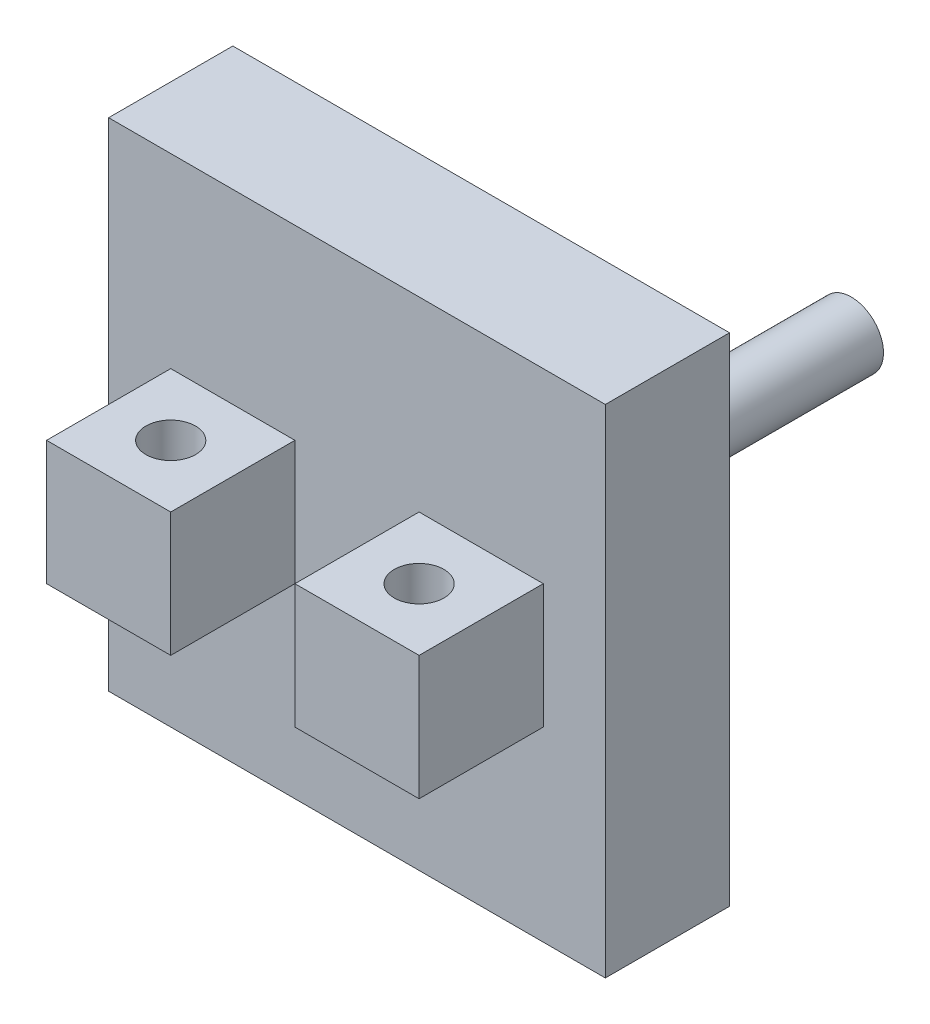
ISO-10303-21;
HEADER;
FILE_DESCRIPTION(('STEP AP214'),'2;1');
FILE_NAME('part.step','',(''),(''),'','','');
FILE_SCHEMA(('AUTOMOTIVE_DESIGN { 1 0 10303 214 1 1 1 1 }'));
ENDSEC;
DATA;
#1=APPLICATION_CONTEXT('core data for automotive mechanical design processes');
#2=APPLICATION_PROTOCOL_DEFINITION('international standard','automotive_design',2000,#1);
#3=PRODUCT_CONTEXT('',#1,'mechanical');
#4=PRODUCT('Part','Part','',(#3));
#5=PRODUCT_RELATED_PRODUCT_CATEGORY('part','',(#4));
#6=PRODUCT_DEFINITION_FORMATION('','',#4);
#7=PRODUCT_DEFINITION_CONTEXT('part definition',#1,'design');
#8=PRODUCT_DEFINITION('design','',#6,#7);
#9=PRODUCT_DEFINITION_SHAPE('','',#8);
#10=(LENGTH_UNIT() NAMED_UNIT(*) SI_UNIT(.MILLI.,.METRE.));
#11=(NAMED_UNIT(*) PLANE_ANGLE_UNIT() SI_UNIT($,.RADIAN.));
#12=(NAMED_UNIT(*) SI_UNIT($,.STERADIAN.) SOLID_ANGLE_UNIT());
#13=UNCERTAINTY_MEASURE_WITH_UNIT(LENGTH_MEASURE(1.E-05),#10,'distance_accuracy_value','');
#14=(GEOMETRIC_REPRESENTATION_CONTEXT(3) GLOBAL_UNCERTAINTY_ASSIGNED_CONTEXT((#13)) GLOBAL_UNIT_ASSIGNED_CONTEXT((#10,
#11,#12)) REPRESENTATION_CONTEXT('',''));
#15=CARTESIAN_POINT('',(0.,0.,0.));
#16=DIRECTION('',(0.,0.,1.));
#17=DIRECTION('',(1.,0.,0.));
#18=AXIS2_PLACEMENT_3D('',#15,#16,#17);
#19=CARTESIAN_POINT('',(150.,50.,0.));
#20=DIRECTION('',(-1.,0.,0.));
#21=DIRECTION('',(0.,0.,1.));
#22=AXIS2_PLACEMENT_3D('',#19,#20,#21);
#23=PLANE('',#22);
#24=DIRECTION('',(0.,-1.,0.));
#25=VECTOR('',#24,1.);
#26=CARTESIAN_POINT('',(150.,0.,-50.));
#27=LINE('',#26,#25);
#28=CARTESIAN_POINT('',(150.,50.,-50.));
#29=VERTEX_POINT('',#28);
#30=CARTESIAN_POINT('',(150.,0.,-50.));
#31=VERTEX_POINT('',#30);
#32=EDGE_CURVE('E151',#29,#31,#27,.T.);
#33=ORIENTED_EDGE('',*,*,#32,.F.);
#34=DIRECTION('',(0.,0.,-1.));
#35=VECTOR('',#34,1.);
#36=CARTESIAN_POINT('',(150.,50.,0.));
#37=LINE('',#36,#35);
#38=CARTESIAN_POINT('',(150.,50.,0.));
#39=VERTEX_POINT('',#38);
#40=EDGE_CURVE('E201',#39,#29,#37,.T.);
#41=ORIENTED_EDGE('',*,*,#40,.F.);
#42=DIRECTION('',(0.,-1.,0.));
#43=VECTOR('',#42,1.);
#44=CARTESIAN_POINT('',(150.,50.,0.));
#45=LINE('',#44,#43);
#46=CARTESIAN_POINT('',(150.,0.,0.));
#47=VERTEX_POINT('',#46);
#48=EDGE_CURVE('E230',#39,#47,#45,.T.);
#49=ORIENTED_EDGE('',*,*,#48,.T.);
#50=DIRECTION('',(0.,0.,-1.));
#51=VECTOR('',#50,1.);
#52=CARTESIAN_POINT('',(150.,0.,0.));
#53=LINE('',#52,#51);
#54=EDGE_CURVE('E214',#47,#31,#53,.T.);
#55=ORIENTED_EDGE('',*,*,#54,.T.);
#56=EDGE_LOOP('',(#33,#41,#49,#55));
#57=FACE_BOUND('',#56,.T.);
#58=ADVANCED_FACE('F39',(#57),#23,.F.);
#59=CARTESIAN_POINT('',(0.,50.,0.));
#60=DIRECTION('',(-1.,0.,0.));
#61=DIRECTION('',(0.,0.,1.));
#62=AXIS2_PLACEMENT_3D('',#59,#60,#61);
#63=PLANE('',#62);
#64=DIRECTION('',(0.,0.,-1.));
#65=VECTOR('',#64,1.);
#66=CARTESIAN_POINT('',(0.,50.,0.));
#67=LINE('',#66,#65);
#68=CARTESIAN_POINT('',(0.,50.,0.));
#69=VERTEX_POINT('',#68);
#70=CARTESIAN_POINT('',(0.,50.,-50.));
#71=VERTEX_POINT('',#70);
#72=EDGE_CURVE('E204',#69,#71,#67,.T.);
#73=ORIENTED_EDGE('',*,*,#72,.T.);
#74=DIRECTION('',(0.,1.,0.));
#75=VECTOR('',#74,1.);
#76=CARTESIAN_POINT('',(0.,0.,-50.));
#77=LINE('',#76,#75);
#78=CARTESIAN_POINT('',(0.,0.,-50.));
#79=VERTEX_POINT('',#78);
#80=EDGE_CURVE('E167',#79,#71,#77,.T.);
#81=ORIENTED_EDGE('',*,*,#80,.F.);
#82=DIRECTION('',(0.,0.,-1.));
#83=VECTOR('',#82,1.);
#84=CARTESIAN_POINT('',(0.,0.,0.));
#85=LINE('',#84,#83);
#86=CARTESIAN_POINT('',(0.,0.,0.));
#87=VERTEX_POINT('',#86);
#88=EDGE_CURVE('E216',#87,#79,#85,.T.);
#89=ORIENTED_EDGE('',*,*,#88,.F.);
#90=DIRECTION('',(0.,-1.,0.));
#91=VECTOR('',#90,1.);
#92=CARTESIAN_POINT('',(0.,50.,0.));
#93=LINE('',#92,#91);
#94=EDGE_CURVE('E228',#69,#87,#93,.T.);
#95=ORIENTED_EDGE('',*,*,#94,.F.);
#96=EDGE_LOOP('',(#73,#81,#89,#95));
#97=FACE_BOUND('',#96,.T.);
#98=ADVANCED_FACE('F256',(#97),#63,.T.);
#99=CARTESIAN_POINT('',(0.,0.,0.));
#100=DIRECTION('',(0.,1.,0.));
#101=DIRECTION('',(0.,0.,1.));
#102=AXIS2_PLACEMENT_3D('',#99,#100,#101);
#103=PLANE('',#102);
#104=CARTESIAN_POINT('',(125.,0.,-25.));
#105=DIRECTION('',(0.,1.,0.));
#106=DIRECTION('',(0.,0.,1.));
#107=AXIS2_PLACEMENT_3D('',#104,#105,#106);
#108=CIRCLE('',#107,10.);
#109=CARTESIAN_POINT('',(125.,0.,-15.));
#110=VERTEX_POINT('',#109);
#111=EDGE_CURVE('E190',#110,#110,#108,.T.);
#112=ORIENTED_EDGE('',*,*,#111,.T.);
#113=EDGE_LOOP('',(#112));
#114=FACE_BOUND('',#113,.T.);
#115=DIRECTION('',(-1.,0.,0.));
#116=VECTOR('',#115,1.);
#117=CARTESIAN_POINT('',(150.,0.,-50.));
#118=LINE('',#117,#116);
#119=CARTESIAN_POINT('',(100.,0.,-50.));
#120=VERTEX_POINT('',#119);
#121=EDGE_CURVE('E50',#31,#120,#118,.T.);
#122=ORIENTED_EDGE('',*,*,#121,.F.);
#123=ORIENTED_EDGE('',*,*,#54,.F.);
#124=DIRECTION('',(1.,0.,0.));
#125=VECTOR('',#124,1.);
#126=CARTESIAN_POINT('',(0.,0.,0.));
#127=LINE('',#126,#125);
#128=CARTESIAN_POINT('',(100.,0.,0.));
#129=VERTEX_POINT('',#128);
#130=EDGE_CURVE('E212',#129,#47,#127,.T.);
#131=ORIENTED_EDGE('',*,*,#130,.F.);
#132=DIRECTION('',(0.,0.,1.));
#133=VECTOR('',#132,1.);
#134=CARTESIAN_POINT('',(100.,0.,0.));
#135=LINE('',#134,#133);
#136=EDGE_CURVE('E193',#120,#129,#135,.T.);
#137=ORIENTED_EDGE('',*,*,#136,.F.);
#138=EDGE_LOOP('',(#122,#123,#131,#137));
#139=FACE_BOUND('',#138,.T.);
#140=ADVANCED_FACE('F253',(#114,#139),#103,.F.);
#141=CARTESIAN_POINT('',(25.,0.,-25.));
#142=DIRECTION('',(0.,1.,0.));
#143=DIRECTION('',(0.,0.,1.));
#144=AXIS2_PLACEMENT_3D('',#141,#142,#143);
#145=CIRCLE('',#144,10.);
#146=CARTESIAN_POINT('',(25.,0.,-15.));
#147=VERTEX_POINT('',#146);
#148=EDGE_CURVE('E184',#147,#147,#145,.T.);
#149=ORIENTED_EDGE('',*,*,#148,.T.);
#150=EDGE_LOOP('',(#149));
#151=FACE_BOUND('',#150,.T.);
#152=CARTESIAN_POINT('',(50.,0.,-50.));
#153=VERTEX_POINT('',#152);
#154=EDGE_CURVE('E11',#153,#79,#118,.T.);
#155=ORIENTED_EDGE('',*,*,#154,.F.);
#156=DIRECTION('',(0.,0.,-1.));
#157=VECTOR('',#156,1.);
#158=CARTESIAN_POINT('',(50.,0.,0.));
#159=LINE('',#158,#157);
#160=CARTESIAN_POINT('',(50.,0.,0.));
#161=VERTEX_POINT('',#160);
#162=EDGE_CURVE('E199',#161,#153,#159,.T.);
#163=ORIENTED_EDGE('',*,*,#162,.F.);
#164=DIRECTION('',(1.,0.,0.));
#165=VECTOR('',#164,1.);
#166=CARTESIAN_POINT('',(0.,0.,0.));
#167=LINE('',#166,#165);
#168=EDGE_CURVE('E219',#87,#161,#167,.T.);
#169=ORIENTED_EDGE('',*,*,#168,.F.);
#170=ORIENTED_EDGE('',*,*,#88,.T.);
#171=EDGE_LOOP('',(#155,#163,#169,#170));
#172=FACE_BOUND('',#171,.T.);
#173=ADVANCED_FACE('F255',(#151,#172),#103,.F.);
#174=CARTESIAN_POINT('',(0.,50.,0.));
#175=DIRECTION('',(0.,1.,0.));
#176=DIRECTION('',(0.,0.,1.));
#177=AXIS2_PLACEMENT_3D('',#174,#175,#176);
#178=PLANE('',#177);
#179=DIRECTION('',(1.,0.,0.));
#180=VECTOR('',#179,1.);
#181=CARTESIAN_POINT('',(150.,50.,-50.));
#182=LINE('',#181,#180);
#183=CARTESIAN_POINT('',(50.,50.,-50.));
#184=VERTEX_POINT('',#183);
#185=EDGE_CURVE('E64',#71,#184,#182,.T.);
#186=ORIENTED_EDGE('',*,*,#185,.F.);
#187=ORIENTED_EDGE('',*,*,#72,.F.);
#188=DIRECTION('',(1.,0.,0.));
#189=VECTOR('',#188,1.);
#190=CARTESIAN_POINT('',(0.,50.,0.));
#191=LINE('',#190,#189);
#192=CARTESIAN_POINT('',(50.,50.,0.));
#193=VERTEX_POINT('',#192);
#194=EDGE_CURVE('E206',#69,#193,#191,.T.);
#195=ORIENTED_EDGE('',*,*,#194,.T.);
#196=DIRECTION('',(0.,0.,-1.));
#197=VECTOR('',#196,1.);
#198=CARTESIAN_POINT('',(50.,50.,0.));
#199=LINE('',#198,#197);
#200=EDGE_CURVE('E208',#193,#184,#199,.T.);
#201=ORIENTED_EDGE('',*,*,#200,.T.);
#202=EDGE_LOOP('',(#186,#187,#195,#201));
#203=FACE_BOUND('',#202,.T.);
#204=CARTESIAN_POINT('',(25.,50.,-25.));
#205=DIRECTION('',(0.,1.,0.));
#206=DIRECTION('',(0.,0.,1.));
#207=AXIS2_PLACEMENT_3D('',#204,#205,#206);
#208=CIRCLE('',#207,10.);
#209=CARTESIAN_POINT('',(25.,50.,-15.));
#210=VERTEX_POINT('',#209);
#211=EDGE_CURVE('E183',#210,#210,#208,.T.);
#212=ORIENTED_EDGE('',*,*,#211,.F.);
#213=EDGE_LOOP('',(#212));
#214=FACE_BOUND('',#213,.T.);
#215=ADVANCED_FACE('F263',(#203,#214),#178,.T.);
#216=CARTESIAN_POINT('',(0.,50.,-50.));
#217=DIRECTION('',(0.,0.,-1.));
#218=DIRECTION('',(-1.,0.,0.));
#219=AXIS2_PLACEMENT_3D('',#216,#217,#218);
#220=PLANE('',#219);
#221=CARTESIAN_POINT('',(100.,50.,-50.));
#222=VERTEX_POINT('',#221);
#223=EDGE_CURVE('E48',#222,#29,#182,.T.);
#224=ORIENTED_EDGE('',*,*,#223,.T.);
#225=ORIENTED_EDGE('',*,*,#32,.T.);
#226=ORIENTED_EDGE('',*,*,#121,.T.);
#227=DIRECTION('',(0.,-1.,0.));
#228=VECTOR('',#227,1.);
#229=CARTESIAN_POINT('',(100.,50.,-50.));
#230=LINE('',#229,#228);
#231=EDGE_CURVE('E43',#222,#120,#230,.T.);
#232=ORIENTED_EDGE('',*,*,#231,.F.);
#233=EDGE_LOOP('',(#224,#225,#226,#232));
#234=FACE_BOUND('',#233,.T.);
#235=ORIENTED_EDGE('',*,*,#80,.T.);
#236=ORIENTED_EDGE('',*,*,#185,.T.);
#237=DIRECTION('',(0.,-1.,0.));
#238=VECTOR('',#237,1.);
#239=CARTESIAN_POINT('',(50.,50.,-50.));
#240=LINE('',#239,#238);
#241=EDGE_CURVE('E210',#184,#153,#240,.T.);
#242=ORIENTED_EDGE('',*,*,#241,.T.);
#243=ORIENTED_EDGE('',*,*,#154,.T.);
#244=EDGE_LOOP('',(#235,#236,#242,#243));
#245=FACE_BOUND('',#244,.T.);
#246=DIRECTION('',(-1.,0.,0.));
#247=VECTOR('',#246,1.);
#248=CARTESIAN_POINT('',(0.,-75.,-50.));
#249=LINE('',#248,#247);
#250=CARTESIAN_POINT('',(175.,-75.,-50.));
#251=VERTEX_POINT('',#250);
#252=CARTESIAN_POINT('',(-25.,-75.,-50.));
#253=VERTEX_POINT('',#252);
#254=EDGE_CURVE('E135',#251,#253,#249,.T.);
#255=ORIENTED_EDGE('',*,*,#254,.F.);
#256=DIRECTION('',(0.,1.,0.));
#257=VECTOR('',#256,1.);
#258=CARTESIAN_POINT('',(175.,0.,-50.));
#259=LINE('',#258,#257);
#260=CARTESIAN_POINT('',(175.,125.,-50.));
#261=VERTEX_POINT('',#260);
#262=EDGE_CURVE('E165',#251,#261,#259,.T.);
#263=ORIENTED_EDGE('',*,*,#262,.T.);
#264=DIRECTION('',(-1.,0.,0.));
#265=VECTOR('',#264,1.);
#266=CARTESIAN_POINT('',(0.,125.,-50.));
#267=LINE('',#266,#265);
#268=CARTESIAN_POINT('',(-25.,125.,-50.));
#269=VERTEX_POINT('',#268);
#270=EDGE_CURVE('E137',#261,#269,#267,.T.);
#271=ORIENTED_EDGE('',*,*,#270,.T.);
#272=DIRECTION('',(0.,-1.,0.));
#273=VECTOR('',#272,1.);
#274=CARTESIAN_POINT('',(-25.,0.,-50.));
#275=LINE('',#274,#273);
#276=EDGE_CURVE('E132',#269,#253,#275,.T.);
#277=ORIENTED_EDGE('',*,*,#276,.T.);
#278=EDGE_LOOP('',(#255,#263,#271,#277));
#279=FACE_BOUND('',#278,.T.);
#280=ADVANCED_FACE('F41',(#234,#245,#279),#220,.F.);
#281=CARTESIAN_POINT('',(100.,50.,0.));
#282=DIRECTION('',(1.,0.,0.));
#283=DIRECTION('',(0.,0.,-1.));
#284=AXIS2_PLACEMENT_3D('',#281,#282,#283);
#285=PLANE('',#284);
#286=ORIENTED_EDGE('',*,*,#136,.T.);
#287=DIRECTION('',(0.,-1.,0.));
#288=VECTOR('',#287,1.);
#289=CARTESIAN_POINT('',(100.,50.,0.));
#290=LINE('',#289,#288);
#291=CARTESIAN_POINT('',(100.,50.,0.));
#292=VERTEX_POINT('',#291);
#293=EDGE_CURVE('E232',#292,#129,#290,.T.);
#294=ORIENTED_EDGE('',*,*,#293,.F.);
#295=DIRECTION('',(0.,0.,1.));
#296=VECTOR('',#295,1.);
#297=CARTESIAN_POINT('',(100.,50.,0.));
#298=LINE('',#297,#296);
#299=EDGE_CURVE('E196',#222,#292,#298,.T.);
#300=ORIENTED_EDGE('',*,*,#299,.F.);
#301=ORIENTED_EDGE('',*,*,#231,.T.);
#302=EDGE_LOOP('',(#286,#294,#300,#301));
#303=FACE_BOUND('',#302,.T.);
#304=ADVANCED_FACE('F249',(#303),#285,.F.);
#305=CARTESIAN_POINT('',(0.,50.,0.));
#306=DIRECTION('',(0.,0.,-1.));
#307=DIRECTION('',(-1.,0.,0.));
#308=AXIS2_PLACEMENT_3D('',#305,#306,#307);
#309=PLANE('',#308);
#310=ORIENTED_EDGE('',*,*,#130,.T.);
#311=ORIENTED_EDGE('',*,*,#48,.F.);
#312=DIRECTION('',(1.,0.,0.));
#313=VECTOR('',#312,1.);
#314=CARTESIAN_POINT('',(0.,50.,0.));
#315=LINE('',#314,#313);
#316=EDGE_CURVE('E198',#292,#39,#315,.T.);
#317=ORIENTED_EDGE('',*,*,#316,.F.);
#318=ORIENTED_EDGE('',*,*,#293,.T.);
#319=EDGE_LOOP('',(#310,#311,#317,#318));
#320=FACE_BOUND('',#319,.T.);
#321=ADVANCED_FACE('F251',(#320),#309,.F.);
#322=CARTESIAN_POINT('',(0.,50.,0.));
#323=DIRECTION('',(0.,0.,-1.));
#324=DIRECTION('',(-1.,0.,0.));
#325=AXIS2_PLACEMENT_3D('',#322,#323,#324);
#326=PLANE('',#325);
#327=ORIENTED_EDGE('',*,*,#168,.T.);
#328=DIRECTION('',(0.,-1.,0.));
#329=VECTOR('',#328,1.);
#330=CARTESIAN_POINT('',(50.,50.,0.));
#331=LINE('',#330,#329);
#332=EDGE_CURVE('E225',#193,#161,#331,.T.);
#333=ORIENTED_EDGE('',*,*,#332,.F.);
#334=ORIENTED_EDGE('',*,*,#194,.F.);
#335=ORIENTED_EDGE('',*,*,#94,.T.);
#336=EDGE_LOOP('',(#327,#333,#334,#335));
#337=FACE_BOUND('',#336,.T.);
#338=ADVANCED_FACE('F277',(#337),#326,.F.);
#339=CARTESIAN_POINT('',(50.,50.,0.));
#340=DIRECTION('',(-1.,0.,0.));
#341=DIRECTION('',(0.,0.,1.));
#342=AXIS2_PLACEMENT_3D('',#339,#340,#341);
#343=PLANE('',#342);
#344=ORIENTED_EDGE('',*,*,#162,.T.);
#345=ORIENTED_EDGE('',*,*,#241,.F.);
#346=ORIENTED_EDGE('',*,*,#200,.F.);
#347=ORIENTED_EDGE('',*,*,#332,.T.);
#348=EDGE_LOOP('',(#344,#345,#346,#347));
#349=FACE_BOUND('',#348,.T.);
#350=ADVANCED_FACE('F291',(#349),#343,.F.);
#351=ORIENTED_EDGE('',*,*,#223,.F.);
#352=ORIENTED_EDGE('',*,*,#299,.T.);
#353=ORIENTED_EDGE('',*,*,#316,.T.);
#354=ORIENTED_EDGE('',*,*,#40,.T.);
#355=EDGE_LOOP('',(#351,#352,#353,#354));
#356=FACE_BOUND('',#355,.T.);
#357=CARTESIAN_POINT('',(125.,50.,-25.));
#358=DIRECTION('',(0.,1.,0.));
#359=DIRECTION('',(0.,0.,1.));
#360=AXIS2_PLACEMENT_3D('',#357,#358,#359);
#361=CIRCLE('',#360,10.);
#362=CARTESIAN_POINT('',(125.,50.,-15.));
#363=VERTEX_POINT('',#362);
#364=EDGE_CURVE('E187',#363,#363,#361,.T.);
#365=ORIENTED_EDGE('',*,*,#364,.F.);
#366=EDGE_LOOP('',(#365));
#367=FACE_BOUND('',#366,.T.);
#368=ADVANCED_FACE('F246',(#356,#367),#178,.T.);
#369=CARTESIAN_POINT('',(125.,0.,-25.));
#370=DIRECTION('',(0.,1.,0.));
#371=DIRECTION('',(0.,0.,1.));
#372=AXIS2_PLACEMENT_3D('',#369,#370,#371);
#373=CYLINDRICAL_SURFACE('',#372,10.);
#374=ORIENTED_EDGE('',*,*,#111,.F.);
#375=EDGE_LOOP('',(#374));
#376=FACE_BOUND('',#375,.T.);
#377=ORIENTED_EDGE('',*,*,#364,.T.);
#378=EDGE_LOOP('',(#377));
#379=FACE_BOUND('',#378,.T.);
#380=ADVANCED_FACE('F290',(#376,#379),#373,.F.);
#381=CARTESIAN_POINT('',(25.,0.,-25.));
#382=DIRECTION('',(0.,1.,0.));
#383=DIRECTION('',(0.,0.,1.));
#384=AXIS2_PLACEMENT_3D('',#381,#382,#383);
#385=CYLINDRICAL_SURFACE('',#384,10.);
#386=ORIENTED_EDGE('',*,*,#148,.F.);
#387=EDGE_LOOP('',(#386));
#388=FACE_BOUND('',#387,.T.);
#389=ORIENTED_EDGE('',*,*,#211,.T.);
#390=EDGE_LOOP('',(#389));
#391=FACE_BOUND('',#390,.T.);
#392=ADVANCED_FACE('F296',(#388,#391),#385,.F.);
#393=CARTESIAN_POINT('',(0.,-75.,-50.));
#394=DIRECTION('',(0.,-1.,0.));
#395=DIRECTION('',(0.,0.,-1.));
#396=AXIS2_PLACEMENT_3D('',#393,#394,#395);
#397=PLANE('',#396);
#398=DIRECTION('',(-1.,0.,0.));
#399=VECTOR('',#398,1.);
#400=CARTESIAN_POINT('',(0.,-75.,-100.));
#401=LINE('',#400,#399);
#402=CARTESIAN_POINT('',(175.,-75.,-100.));
#403=VERTEX_POINT('',#402);
#404=CARTESIAN_POINT('',(-25.,-75.,-100.));
#405=VERTEX_POINT('',#404);
#406=EDGE_CURVE('E172',#403,#405,#401,.T.);
#407=ORIENTED_EDGE('',*,*,#406,.F.);
#408=DIRECTION('',(0.,0.,-1.));
#409=VECTOR('',#408,1.);
#410=CARTESIAN_POINT('',(175.,-75.,-50.));
#411=LINE('',#410,#409);
#412=EDGE_CURVE('E154',#251,#403,#411,.T.);
#413=ORIENTED_EDGE('',*,*,#412,.F.);
#414=ORIENTED_EDGE('',*,*,#254,.T.);
#415=DIRECTION('',(0.,0.,-1.));
#416=VECTOR('',#415,1.);
#417=CARTESIAN_POINT('',(-25.,-75.,-50.));
#418=LINE('',#417,#416);
#419=EDGE_CURVE('E143',#253,#405,#418,.T.);
#420=ORIENTED_EDGE('',*,*,#419,.T.);
#421=EDGE_LOOP('',(#407,#413,#414,#420));
#422=FACE_BOUND('',#421,.T.);
#423=ADVANCED_FACE('F153',(#422),#397,.T.);
#424=CARTESIAN_POINT('',(175.,0.,-50.));
#425=DIRECTION('',(-1.,0.,0.));
#426=DIRECTION('',(0.,0.,1.));
#427=AXIS2_PLACEMENT_3D('',#424,#425,#426);
#428=PLANE('',#427);
#429=DIRECTION('',(0.,1.,0.));
#430=VECTOR('',#429,1.);
#431=CARTESIAN_POINT('',(175.,0.,-100.));
#432=LINE('',#431,#430);
#433=CARTESIAN_POINT('',(175.,125.,-100.));
#434=VERTEX_POINT('',#433);
#435=EDGE_CURVE('E156',#403,#434,#432,.T.);
#436=ORIENTED_EDGE('',*,*,#435,.T.);
#437=DIRECTION('',(0.,0.,-1.));
#438=VECTOR('',#437,1.);
#439=CARTESIAN_POINT('',(175.,125.,-50.));
#440=LINE('',#439,#438);
#441=EDGE_CURVE('E178',#261,#434,#440,.T.);
#442=ORIENTED_EDGE('',*,*,#441,.F.);
#443=ORIENTED_EDGE('',*,*,#262,.F.);
#444=ORIENTED_EDGE('',*,*,#412,.T.);
#445=EDGE_LOOP('',(#436,#442,#443,#444));
#446=FACE_BOUND('',#445,.T.);
#447=ADVANCED_FACE('F484',(#446),#428,.F.);
#448=CARTESIAN_POINT('',(0.,125.,-50.));
#449=DIRECTION('',(0.,-1.,0.));
#450=DIRECTION('',(0.,0.,-1.));
#451=AXIS2_PLACEMENT_3D('',#448,#449,#450);
#452=PLANE('',#451);
#453=DIRECTION('',(-1.,0.,0.));
#454=VECTOR('',#453,1.);
#455=CARTESIAN_POINT('',(0.,125.,-100.));
#456=LINE('',#455,#454);
#457=CARTESIAN_POINT('',(-25.,125.,-100.));
#458=VERTEX_POINT('',#457);
#459=EDGE_CURVE('E158',#434,#458,#456,.T.);
#460=ORIENTED_EDGE('',*,*,#459,.T.);
#461=DIRECTION('',(0.,0.,-1.));
#462=VECTOR('',#461,1.);
#463=CARTESIAN_POINT('',(-25.,125.,-50.));
#464=LINE('',#463,#462);
#465=EDGE_CURVE('E150',#269,#458,#464,.T.);
#466=ORIENTED_EDGE('',*,*,#465,.F.);
#467=ORIENTED_EDGE('',*,*,#270,.F.);
#468=ORIENTED_EDGE('',*,*,#441,.T.);
#469=EDGE_LOOP('',(#460,#466,#467,#468));
#470=FACE_BOUND('',#469,.T.);
#471=ADVANCED_FACE('F426',(#470),#452,.F.);
#472=CARTESIAN_POINT('',(-25.,0.,-50.));
#473=DIRECTION('',(1.,0.,0.));
#474=DIRECTION('',(0.,0.,-1.));
#475=AXIS2_PLACEMENT_3D('',#472,#473,#474);
#476=PLANE('',#475);
#477=DIRECTION('',(0.,-1.,0.));
#478=VECTOR('',#477,1.);
#479=CARTESIAN_POINT('',(-25.,0.,-100.));
#480=LINE('',#479,#478);
#481=EDGE_CURVE('E146',#458,#405,#480,.T.);
#482=ORIENTED_EDGE('',*,*,#481,.T.);
#483=ORIENTED_EDGE('',*,*,#419,.F.);
#484=ORIENTED_EDGE('',*,*,#276,.F.);
#485=ORIENTED_EDGE('',*,*,#465,.T.);
#486=EDGE_LOOP('',(#482,#483,#484,#485));
#487=FACE_BOUND('',#486,.T.);
#488=ADVANCED_FACE('F144',(#487),#476,.F.);
#489=CARTESIAN_POINT('',(0.,50.,-100.));
#490=DIRECTION('',(0.,0.,-1.));
#491=DIRECTION('',(-1.,0.,0.));
#492=AXIS2_PLACEMENT_3D('',#489,#490,#491);
#493=PLANE('',#492);
#494=CARTESIAN_POINT('',(100.,25.,-100.));
#495=DIRECTION('',(0.,0.,-1.));
#496=DIRECTION('',(-1.,0.,0.));
#497=AXIS2_PLACEMENT_3D('',#494,#495,#496);
#498=CIRCLE('',#497,32.);
#499=CARTESIAN_POINT('',(68.,25.,-100.));
#500=VERTEX_POINT('',#499);
#501=EDGE_CURVE('E161',#500,#500,#498,.T.);
#502=ORIENTED_EDGE('',*,*,#501,.F.);
#503=EDGE_LOOP('',(#502));
#504=FACE_BOUND('',#503,.T.);
#505=ORIENTED_EDGE('',*,*,#406,.T.);
#506=ORIENTED_EDGE('',*,*,#481,.F.);
#507=ORIENTED_EDGE('',*,*,#459,.F.);
#508=ORIENTED_EDGE('',*,*,#435,.F.);
#509=EDGE_LOOP('',(#505,#506,#507,#508));
#510=FACE_BOUND('',#509,.T.);
#511=ADVANCED_FACE('F275',(#504,#510),#493,.T.);
#512=CARTESIAN_POINT('',(100.,25.,-112.));
#513=DIRECTION('',(0.,0.,1.));
#514=DIRECTION('',(1.,0.,0.));
#515=AXIS2_PLACEMENT_3D('',#512,#513,#514);
#516=CYLINDRICAL_SURFACE('',#515,32.);
#517=CARTESIAN_POINT('',(100.,25.,-112.));
#518=DIRECTION('',(0.,0.,-1.));
#519=DIRECTION('',(-1.,0.,0.));
#520=AXIS2_PLACEMENT_3D('',#517,#518,#519);
#521=CIRCLE('',#520,32.);
#522=CARTESIAN_POINT('',(68.,25.,-112.));
#523=VERTEX_POINT('',#522);
#524=EDGE_CURVE('E174',#523,#523,#521,.T.);
#525=ORIENTED_EDGE('',*,*,#524,.F.);
#526=EDGE_LOOP('',(#525));
#527=FACE_BOUND('',#526,.T.);
#528=ORIENTED_EDGE('',*,*,#501,.T.);
#529=EDGE_LOOP('',(#528));
#530=FACE_BOUND('',#529,.T.);
#531=ADVANCED_FACE('F333',(#527,#530),#516,.T.);
#532=CARTESIAN_POINT('',(100.,25.,-112.));
#533=DIRECTION('',(0.,0.,-1.));
#534=DIRECTION('',(-1.,0.,0.));
#535=AXIS2_PLACEMENT_3D('',#532,#533,#534);
#536=PLANE('',#535);
#537=CARTESIAN_POINT('',(100.,25.,-112.));
#538=DIRECTION('',(0.,0.,-1.));
#539=DIRECTION('',(-1.,0.,0.));
#540=AXIS2_PLACEMENT_3D('',#537,#538,#539);
#541=CIRCLE('',#540,13.);
#542=CARTESIAN_POINT('',(87.,25.,-112.));
#543=VERTEX_POINT('',#542);
#544=EDGE_CURVE('E530',#543,#543,#541,.T.);
#545=ORIENTED_EDGE('',*,*,#544,.F.);
#546=EDGE_LOOP('',(#545));
#547=FACE_BOUND('',#546,.T.);
#548=ORIENTED_EDGE('',*,*,#524,.T.);
#549=EDGE_LOOP('',(#548));
#550=FACE_BOUND('',#549,.T.);
#551=ADVANCED_FACE('F448',(#547,#550),#536,.T.);
#552=CARTESIAN_POINT('',(100.,25.,-224.));
#553=DIRECTION('',(0.,0.,1.));
#554=DIRECTION('',(1.,0.,0.));
#555=AXIS2_PLACEMENT_3D('',#552,#553,#554);
#556=CYLINDRICAL_SURFACE('',#555,13.);
#557=CARTESIAN_POINT('',(100.,25.,-224.));
#558=DIRECTION('',(0.,0.,-1.));
#559=DIRECTION('',(-1.,0.,0.));
#560=AXIS2_PLACEMENT_3D('',#557,#558,#559);
#561=CIRCLE('',#560,13.);
#562=CARTESIAN_POINT('',(87.,25.,-224.));
#563=VERTEX_POINT('',#562);
#564=EDGE_CURVE('E529',#563,#563,#561,.T.);
#565=ORIENTED_EDGE('',*,*,#564,.F.);
#566=EDGE_LOOP('',(#565));
#567=FACE_BOUND('',#566,.T.);
#568=ORIENTED_EDGE('',*,*,#544,.T.);
#569=EDGE_LOOP('',(#568));
#570=FACE_BOUND('',#569,.T.);
#571=ADVANCED_FACE('F458',(#567,#570),#556,.T.);
#572=CARTESIAN_POINT('',(100.,25.,-224.));
#573=DIRECTION('',(0.,0.,-1.));
#574=DIRECTION('',(-1.,0.,0.));
#575=AXIS2_PLACEMENT_3D('',#572,#573,#574);
#576=PLANE('',#575);
#577=ORIENTED_EDGE('',*,*,#564,.T.);
#578=EDGE_LOOP('',(#577));
#579=FACE_BOUND('',#578,.T.);
#580=ADVANCED_FACE('F468',(#579),#576,.T.);
#581=CLOSED_SHELL('',(#58,#98,#140,#173,#215,#280,#304,#321,#338,#350,#368,#380,#392,#423,#447,
#471,#488,#511,#531,#551,#571,#580));
#582=MANIFOLD_SOLID_BREP('B2',#581);
#583=ADVANCED_BREP_SHAPE_REPRESENTATION('',(#18,#582),#14);
#584=SHAPE_DEFINITION_REPRESENTATION(#9,#583);
ENDSEC;
END-ISO-10303-21;
